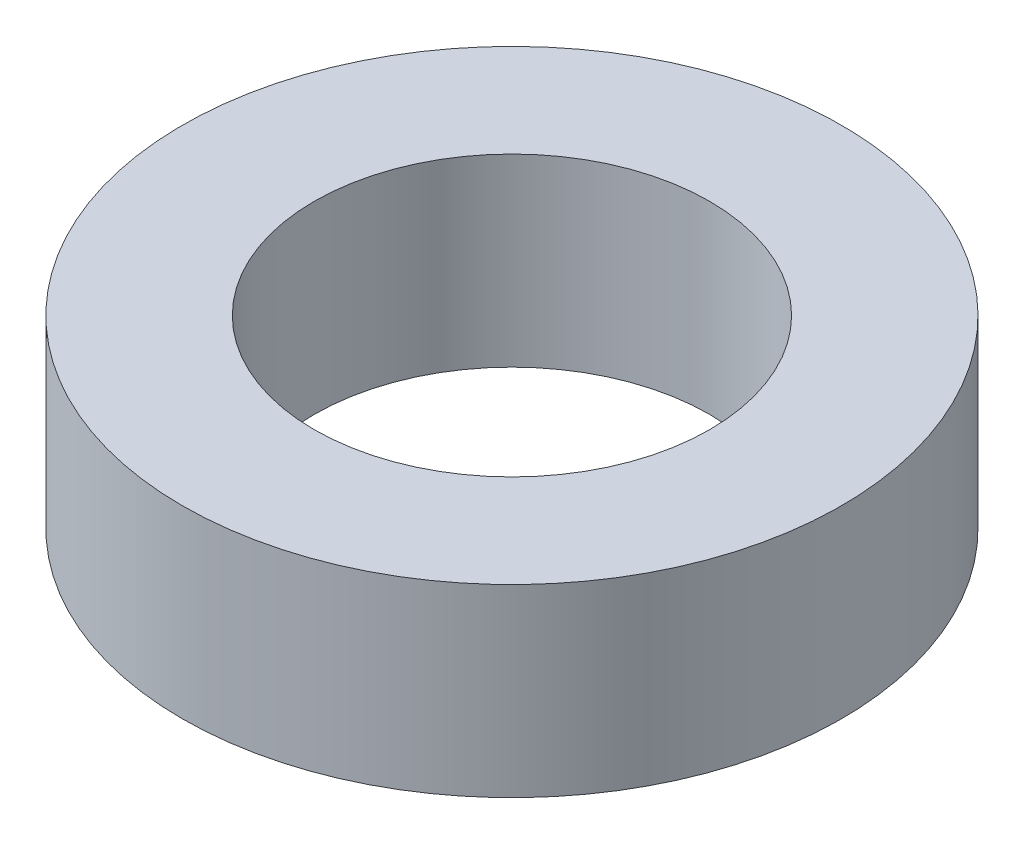
ISO-10303-21;
HEADER;
FILE_DESCRIPTION(('STEP AP214'),'2;1');
FILE_NAME('part.step','',(''),(''),'','','');
FILE_SCHEMA(('AUTOMOTIVE_DESIGN { 1 0 10303 214 1 1 1 1 }'));
ENDSEC;
DATA;
#1=APPLICATION_CONTEXT('core data for automotive mechanical design processes');
#2=APPLICATION_PROTOCOL_DEFINITION('international standard','automotive_design',2000,#1);
#3=PRODUCT_CONTEXT('',#1,'mechanical');
#4=PRODUCT('Part','Part','',(#3));
#5=PRODUCT_RELATED_PRODUCT_CATEGORY('part','',(#4));
#6=PRODUCT_DEFINITION_FORMATION('','',#4);
#7=PRODUCT_DEFINITION_CONTEXT('part definition',#1,'design');
#8=PRODUCT_DEFINITION('design','',#6,#7);
#9=PRODUCT_DEFINITION_SHAPE('','',#8);
#10=(LENGTH_UNIT() NAMED_UNIT(*) SI_UNIT(.MILLI.,.METRE.));
#11=(NAMED_UNIT(*) PLANE_ANGLE_UNIT() SI_UNIT($,.RADIAN.));
#12=(NAMED_UNIT(*) SI_UNIT($,.STERADIAN.) SOLID_ANGLE_UNIT());
#13=UNCERTAINTY_MEASURE_WITH_UNIT(LENGTH_MEASURE(1.E-05),#10,'distance_accuracy_value','');
#14=(GEOMETRIC_REPRESENTATION_CONTEXT(3) GLOBAL_UNCERTAINTY_ASSIGNED_CONTEXT((#13)) GLOBAL_UNIT_ASSIGNED_CONTEXT((#10,
#11,#12)) REPRESENTATION_CONTEXT('',''));
#15=CARTESIAN_POINT('',(0.,0.,0.));
#16=DIRECTION('',(0.,0.,1.));
#17=DIRECTION('',(1.,0.,0.));
#18=AXIS2_PLACEMENT_3D('',#15,#16,#17);
#19=CARTESIAN_POINT('',(0.,28.,0.));
#20=DIRECTION('',(0.,-1.,0.));
#21=DIRECTION('',(0.,0.,-1.));
#22=AXIS2_PLACEMENT_3D('',#19,#20,#21);
#23=CYLINDRICAL_SURFACE('',#22,50.);
#24=CARTESIAN_POINT('',(0.,28.,0.));
#25=DIRECTION('',(0.,1.,0.));
#26=DIRECTION('',(0.,0.,1.));
#27=AXIS2_PLACEMENT_3D('',#24,#25,#26);
#28=CIRCLE('',#27,50.);
#29=CARTESIAN_POINT('',(0.,28.,50.));
#30=VERTEX_POINT('',#29);
#31=EDGE_CURVE('E10',#30,#30,#28,.T.);
#32=ORIENTED_EDGE('',*,*,#31,.F.);
#33=EDGE_LOOP('',(#32));
#34=FACE_BOUND('',#33,.T.);
#35=CARTESIAN_POINT('',(0.,0.,0.));
#36=DIRECTION('',(0.,1.,0.));
#37=DIRECTION('',(0.,0.,1.));
#38=AXIS2_PLACEMENT_3D('',#35,#36,#37);
#39=CIRCLE('',#38,50.);
#40=CARTESIAN_POINT('',(0.,0.,50.));
#41=VERTEX_POINT('',#40);
#42=EDGE_CURVE('E37',#41,#41,#39,.T.);
#43=ORIENTED_EDGE('',*,*,#42,.T.);
#44=EDGE_LOOP('',(#43));
#45=FACE_BOUND('',#44,.T.);
#46=ADVANCED_FACE('F40',(#34,#45),#23,.T.);
#47=CARTESIAN_POINT('',(0.,28.,0.));
#48=DIRECTION('',(0.,1.,0.));
#49=DIRECTION('',(0.,0.,1.));
#50=AXIS2_PLACEMENT_3D('',#47,#48,#49);
#51=PLANE('',#50);
#52=CARTESIAN_POINT('',(0.,28.,0.));
#53=DIRECTION('',(0.,1.,0.));
#54=DIRECTION('',(0.,0.,1.));
#55=AXIS2_PLACEMENT_3D('',#52,#53,#54);
#56=CIRCLE('',#55,30.);
#57=CARTESIAN_POINT('',(0.,28.,30.));
#58=VERTEX_POINT('',#57);
#59=EDGE_CURVE('E50',#58,#58,#56,.T.);
#60=ORIENTED_EDGE('',*,*,#59,.F.);
#61=EDGE_LOOP('',(#60));
#62=FACE_BOUND('',#61,.T.);
#63=ORIENTED_EDGE('',*,*,#31,.T.);
#64=EDGE_LOOP('',(#63));
#65=FACE_BOUND('',#64,.T.);
#66=ADVANCED_FACE('F59',(#62,#65),#51,.T.);
#67=CARTESIAN_POINT('',(0.,0.,0.));
#68=DIRECTION('',(0.,1.,0.));
#69=DIRECTION('',(0.,0.,1.));
#70=AXIS2_PLACEMENT_3D('',#67,#68,#69);
#71=PLANE('',#70);
#72=CARTESIAN_POINT('',(0.,0.,0.));
#73=DIRECTION('',(0.,1.,0.));
#74=DIRECTION('',(0.,0.,1.));
#75=AXIS2_PLACEMENT_3D('',#72,#73,#74);
#76=CIRCLE('',#75,30.);
#77=CARTESIAN_POINT('',(0.,0.,30.));
#78=VERTEX_POINT('',#77);
#79=EDGE_CURVE('E47',#78,#78,#76,.T.);
#80=ORIENTED_EDGE('',*,*,#79,.T.);
#81=EDGE_LOOP('',(#80));
#82=FACE_BOUND('',#81,.T.);
#83=ORIENTED_EDGE('',*,*,#42,.F.);
#84=EDGE_LOOP('',(#83));
#85=FACE_BOUND('',#84,.T.);
#86=ADVANCED_FACE('F58',(#82,#85),#71,.F.);
#87=CARTESIAN_POINT('',(0.,28.,0.));
#88=DIRECTION('',(0.,-1.,0.));
#89=DIRECTION('',(0.,0.,-1.));
#90=AXIS2_PLACEMENT_3D('',#87,#88,#89);
#91=CYLINDRICAL_SURFACE('',#90,30.);
#92=ORIENTED_EDGE('',*,*,#59,.T.);
#93=EDGE_LOOP('',(#92));
#94=FACE_BOUND('',#93,.T.);
#95=ORIENTED_EDGE('',*,*,#79,.F.);
#96=EDGE_LOOP('',(#95));
#97=FACE_BOUND('',#96,.T.);
#98=ADVANCED_FACE('F54',(#94,#97),#91,.F.);
#99=CLOSED_SHELL('',(#46,#66,#86,#98));
#100=MANIFOLD_SOLID_BREP('B2',#99);
#101=ADVANCED_BREP_SHAPE_REPRESENTATION('',(#18,#100),#14);
#102=SHAPE_DEFINITION_REPRESENTATION(#9,#101);
ENDSEC;
END-ISO-10303-21;
